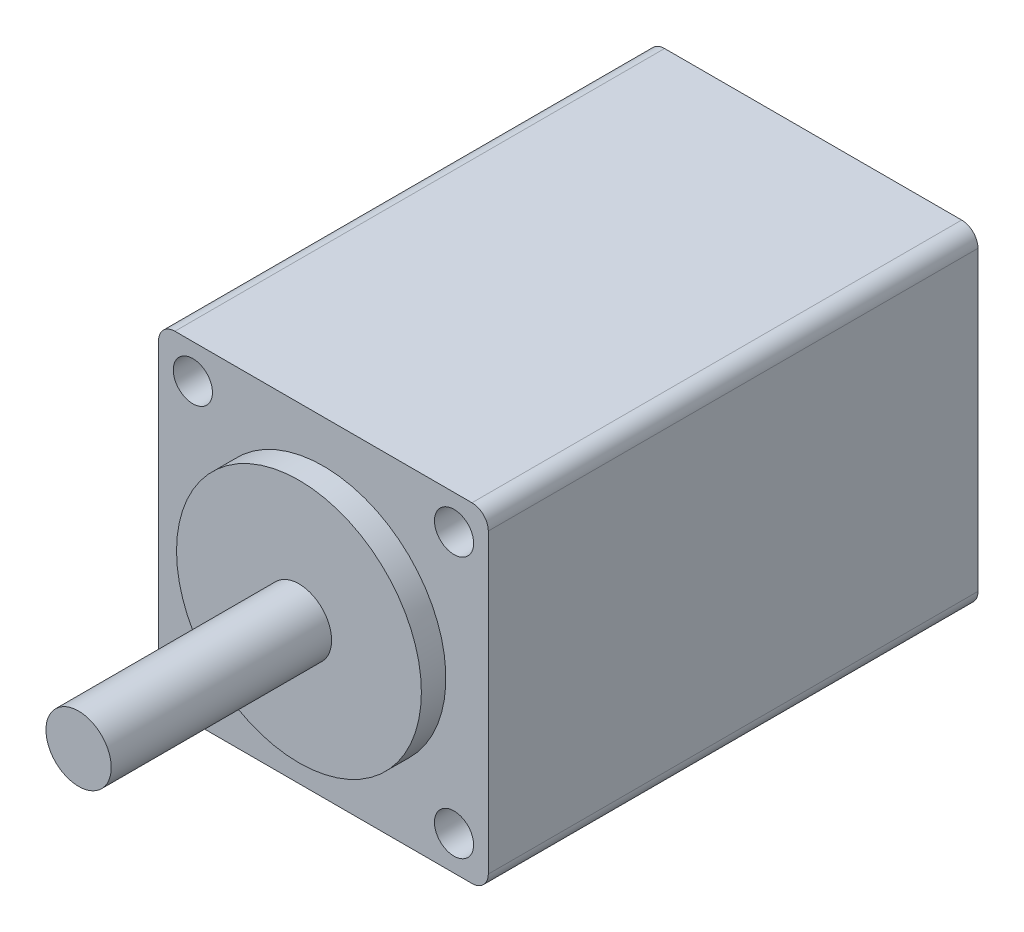
ISO-10303-21;
HEADER;
FILE_DESCRIPTION(('STEP AP214'),'2;1');
FILE_NAME('part.step','',(''),(''),'','','');
FILE_SCHEMA(('AUTOMOTIVE_DESIGN { 1 0 10303 214 1 1 1 1 }'));
ENDSEC;
DATA;
#1=APPLICATION_CONTEXT('core data for automotive mechanical design processes');
#2=APPLICATION_PROTOCOL_DEFINITION('international standard','automotive_design',2000,#1);
#3=PRODUCT_CONTEXT('',#1,'mechanical');
#4=PRODUCT('Part','Part','',(#3));
#5=PRODUCT_RELATED_PRODUCT_CATEGORY('part','',(#4));
#6=PRODUCT_DEFINITION_FORMATION('','',#4);
#7=PRODUCT_DEFINITION_CONTEXT('part definition',#1,'design');
#8=PRODUCT_DEFINITION('design','',#6,#7);
#9=PRODUCT_DEFINITION_SHAPE('','',#8);
#10=(LENGTH_UNIT() NAMED_UNIT(*) SI_UNIT(.MILLI.,.METRE.));
#11=(NAMED_UNIT(*) PLANE_ANGLE_UNIT() SI_UNIT($,.RADIAN.));
#12=(NAMED_UNIT(*) SI_UNIT($,.STERADIAN.) SOLID_ANGLE_UNIT());
#13=UNCERTAINTY_MEASURE_WITH_UNIT(LENGTH_MEASURE(1.E-05),#10,'distance_accuracy_value','');
#14=(GEOMETRIC_REPRESENTATION_CONTEXT(3) GLOBAL_UNCERTAINTY_ASSIGNED_CONTEXT((#13)) GLOBAL_UNIT_ASSIGNED_CONTEXT((#10,
#11,#12)) REPRESENTATION_CONTEXT('',''));
#15=CARTESIAN_POINT('',(0.,0.,0.));
#16=DIRECTION('',(0.,0.,1.));
#17=DIRECTION('',(1.,0.,0.));
#18=AXIS2_PLACEMENT_3D('',#15,#16,#17);
#19=CARTESIAN_POINT('',(-10.1,-10.1,-30.));
#20=DIRECTION('',(-1.,0.,0.));
#21=DIRECTION('',(0.,0.,1.));
#22=AXIS2_PLACEMENT_3D('',#19,#20,#21);
#23=PLANE('',#22);
#24=DIRECTION('',(0.,-1.,0.));
#25=VECTOR('',#24,1.);
#26=CARTESIAN_POINT('',(-10.1,-10.1,0.));
#27=LINE('',#26,#25);
#28=CARTESIAN_POINT('',(-10.1,9.1,0.));
#29=VERTEX_POINT('',#28);
#30=CARTESIAN_POINT('',(-10.1,-9.1,0.));
#31=VERTEX_POINT('',#30);
#32=EDGE_CURVE('E159',#29,#31,#27,.T.);
#33=ORIENTED_EDGE('',*,*,#32,.F.);
#34=DIRECTION('',(0.,0.,1.));
#35=VECTOR('',#34,1.);
#36=CARTESIAN_POINT('',(-10.1,9.1,-30.));
#37=LINE('',#36,#35);
#38=CARTESIAN_POINT('',(-10.1,9.1,-30.));
#39=VERTEX_POINT('',#38);
#40=EDGE_CURVE('E137',#29,#39,#37,.F.);
#41=ORIENTED_EDGE('',*,*,#40,.T.);
#42=DIRECTION('',(0.,-1.,0.));
#43=VECTOR('',#42,1.);
#44=CARTESIAN_POINT('',(-10.1,-10.1,-30.));
#45=LINE('',#44,#43);
#46=CARTESIAN_POINT('',(-10.1,-9.1,-30.));
#47=VERTEX_POINT('',#46);
#48=EDGE_CURVE('E118',#39,#47,#45,.T.);
#49=ORIENTED_EDGE('',*,*,#48,.T.);
#50=DIRECTION('',(0.,0.,1.));
#51=VECTOR('',#50,1.);
#52=CARTESIAN_POINT('',(-10.1,-9.1,-30.));
#53=LINE('',#52,#51);
#54=EDGE_CURVE('E134',#47,#31,#53,.T.);
#55=ORIENTED_EDGE('',*,*,#54,.T.);
#56=EDGE_LOOP('',(#33,#41,#49,#55));
#57=FACE_BOUND('',#56,.T.);
#58=ADVANCED_FACE('F32',(#57),#23,.T.);
#59=CARTESIAN_POINT('',(-10.1,10.1,-30.));
#60=DIRECTION('',(0.,1.,0.));
#61=DIRECTION('',(0.,0.,1.));
#62=AXIS2_PLACEMENT_3D('',#59,#60,#61);
#63=PLANE('',#62);
#64=DIRECTION('',(-1.,0.,0.));
#65=VECTOR('',#64,1.);
#66=CARTESIAN_POINT('',(-10.1,10.1,-30.));
#67=LINE('',#66,#65);
#68=CARTESIAN_POINT('',(9.10000000000001,10.1,-30.));
#69=VERTEX_POINT('',#68);
#70=CARTESIAN_POINT('',(-9.1,10.1,-30.));
#71=VERTEX_POINT('',#70);
#72=EDGE_CURVE('E126',#69,#71,#67,.T.);
#73=ORIENTED_EDGE('',*,*,#72,.T.);
#74=DIRECTION('',(0.,0.,1.));
#75=VECTOR('',#74,1.);
#76=CARTESIAN_POINT('',(-9.1,10.1,-30.));
#77=LINE('',#76,#75);
#78=CARTESIAN_POINT('',(-9.1,10.1,0.));
#79=VERTEX_POINT('',#78);
#80=EDGE_CURVE('E109',#71,#79,#77,.T.);
#81=ORIENTED_EDGE('',*,*,#80,.T.);
#82=DIRECTION('',(-1.,0.,0.));
#83=VECTOR('',#82,1.);
#84=CARTESIAN_POINT('',(-10.1,10.1,0.));
#85=LINE('',#84,#83);
#86=CARTESIAN_POINT('',(9.10000000000001,10.1,0.));
#87=VERTEX_POINT('',#86);
#88=EDGE_CURVE('E101',#87,#79,#85,.T.);
#89=ORIENTED_EDGE('',*,*,#88,.F.);
#90=DIRECTION('',(0.,0.,1.));
#91=VECTOR('',#90,1.);
#92=CARTESIAN_POINT('',(9.10000000000001,10.1,-30.));
#93=LINE('',#92,#91);
#94=EDGE_CURVE('E115',#87,#69,#93,.F.);
#95=ORIENTED_EDGE('',*,*,#94,.T.);
#96=EDGE_LOOP('',(#73,#81,#89,#95));
#97=FACE_BOUND('',#96,.T.);
#98=ADVANCED_FACE('F114',(#97),#63,.T.);
#99=CARTESIAN_POINT('',(10.1,-10.1,-30.));
#100=DIRECTION('',(1.,0.,0.));
#101=DIRECTION('',(0.,1.,0.));
#102=AXIS2_PLACEMENT_3D('',#99,#100,#101);
#103=PLANE('',#102);
#104=DIRECTION('',(0.,1.,0.));
#105=VECTOR('',#104,1.);
#106=CARTESIAN_POINT('',(10.1,-10.1,0.));
#107=LINE('',#106,#105);
#108=CARTESIAN_POINT('',(10.1,-9.1,0.));
#109=VERTEX_POINT('',#108);
#110=CARTESIAN_POINT('',(10.1,9.1,0.));
#111=VERTEX_POINT('',#110);
#112=EDGE_CURVE('E103',#109,#111,#107,.T.);
#113=ORIENTED_EDGE('',*,*,#112,.F.);
#114=DIRECTION('',(0.,0.,1.));
#115=VECTOR('',#114,1.);
#116=CARTESIAN_POINT('',(10.1,-9.1,-30.));
#117=LINE('',#116,#115);
#118=CARTESIAN_POINT('',(10.1,-9.1,-30.));
#119=VERTEX_POINT('',#118);
#120=EDGE_CURVE('E11',#109,#119,#117,.F.);
#121=ORIENTED_EDGE('',*,*,#120,.T.);
#122=DIRECTION('',(0.,1.,0.));
#123=VECTOR('',#122,1.);
#124=CARTESIAN_POINT('',(10.1,-10.1,-30.));
#125=LINE('',#124,#123);
#126=CARTESIAN_POINT('',(10.1,9.1,-30.));
#127=VERTEX_POINT('',#126);
#128=EDGE_CURVE('E152',#119,#127,#125,.T.);
#129=ORIENTED_EDGE('',*,*,#128,.T.);
#130=DIRECTION('',(0.,0.,1.));
#131=VECTOR('',#130,1.);
#132=CARTESIAN_POINT('',(10.1,9.1,-30.));
#133=LINE('',#132,#131);
#134=EDGE_CURVE('E40',#127,#111,#133,.T.);
#135=ORIENTED_EDGE('',*,*,#134,.T.);
#136=EDGE_LOOP('',(#113,#121,#129,#135));
#137=FACE_BOUND('',#136,.T.);
#138=ADVANCED_FACE('F150',(#137),#103,.T.);
#139=CARTESIAN_POINT('',(-10.1,-10.1,-30.));
#140=DIRECTION('',(0.,-1.,0.));
#141=DIRECTION('',(1.,0.,0.));
#142=AXIS2_PLACEMENT_3D('',#139,#140,#141);
#143=PLANE('',#142);
#144=DIRECTION('',(1.,0.,0.));
#145=VECTOR('',#144,1.);
#146=CARTESIAN_POINT('',(-10.1,-10.1,0.));
#147=LINE('',#146,#145);
#148=CARTESIAN_POINT('',(-9.1,-10.1,0.));
#149=VERTEX_POINT('',#148);
#150=CARTESIAN_POINT('',(9.1,-10.1,0.));
#151=VERTEX_POINT('',#150);
#152=EDGE_CURVE('E162',#149,#151,#147,.T.);
#153=ORIENTED_EDGE('',*,*,#152,.F.);
#154=DIRECTION('',(0.,0.,1.));
#155=VECTOR('',#154,1.);
#156=CARTESIAN_POINT('',(-9.1,-10.1,-30.));
#157=LINE('',#156,#155);
#158=CARTESIAN_POINT('',(-9.1,-10.1,-30.));
#159=VERTEX_POINT('',#158);
#160=EDGE_CURVE('E54',#149,#159,#157,.F.);
#161=ORIENTED_EDGE('',*,*,#160,.T.);
#162=DIRECTION('',(1.,0.,0.));
#163=VECTOR('',#162,1.);
#164=CARTESIAN_POINT('',(-10.1,-10.1,-30.));
#165=LINE('',#164,#163);
#166=CARTESIAN_POINT('',(9.1,-10.1,-30.));
#167=VERTEX_POINT('',#166);
#168=EDGE_CURVE('E153',#159,#167,#165,.T.);
#169=ORIENTED_EDGE('',*,*,#168,.T.);
#170=DIRECTION('',(0.,0.,1.));
#171=VECTOR('',#170,1.);
#172=CARTESIAN_POINT('',(9.1,-10.1,-30.));
#173=LINE('',#172,#171);
#174=EDGE_CURVE('E145',#167,#151,#173,.T.);
#175=ORIENTED_EDGE('',*,*,#174,.T.);
#176=EDGE_LOOP('',(#153,#161,#169,#175));
#177=FACE_BOUND('',#176,.T.);
#178=ADVANCED_FACE('F166',(#177),#143,.T.);
#179=CARTESIAN_POINT('',(0.,0.,-30.));
#180=DIRECTION('',(0.,0.,-1.));
#181=DIRECTION('',(-1.,0.,0.));
#182=AXIS2_PLACEMENT_3D('',#179,#180,#181);
#183=PLANE('',#182);
#184=ORIENTED_EDGE('',*,*,#48,.F.);
#185=CARTESIAN_POINT('',(-9.1,9.1,-30.));
#186=DIRECTION('',(0.,0.,-1.));
#187=DIRECTION('',(-1.,0.,0.));
#188=AXIS2_PLACEMENT_3D('',#185,#186,#187);
#189=CIRCLE('',#188,1.);
#190=EDGE_CURVE('E143',#39,#71,#189,.T.);
#191=ORIENTED_EDGE('',*,*,#190,.T.);
#192=ORIENTED_EDGE('',*,*,#72,.F.);
#193=CARTESIAN_POINT('',(9.1,9.1,-30.));
#194=DIRECTION('',(0.,0.,-1.));
#195=DIRECTION('',(-1.,0.,0.));
#196=AXIS2_PLACEMENT_3D('',#193,#194,#195);
#197=CIRCLE('',#196,1.);
#198=EDGE_CURVE('E121',#69,#127,#197,.T.);
#199=ORIENTED_EDGE('',*,*,#198,.T.);
#200=ORIENTED_EDGE('',*,*,#128,.F.);
#201=CARTESIAN_POINT('',(9.1,-9.1,-30.));
#202=DIRECTION('',(0.,0.,-1.));
#203=DIRECTION('',(-1.,0.,0.));
#204=AXIS2_PLACEMENT_3D('',#201,#202,#203);
#205=CIRCLE('',#204,1.);
#206=EDGE_CURVE('E47',#119,#167,#205,.T.);
#207=ORIENTED_EDGE('',*,*,#206,.T.);
#208=ORIENTED_EDGE('',*,*,#168,.F.);
#209=CARTESIAN_POINT('',(-9.1,-9.1,-30.));
#210=DIRECTION('',(0.,0.,-1.));
#211=DIRECTION('',(-1.,0.,0.));
#212=AXIS2_PLACEMENT_3D('',#209,#210,#211);
#213=CIRCLE('',#212,1.);
#214=EDGE_CURVE('E141',#159,#47,#213,.T.);
#215=ORIENTED_EDGE('',*,*,#214,.T.);
#216=EDGE_LOOP('',(#184,#191,#192,#199,#200,#207,#208,#215));
#217=FACE_BOUND('',#216,.T.);
#218=ADVANCED_FACE('F174',(#217),#183,.T.);
#219=CARTESIAN_POINT('',(0.,0.,0.));
#220=DIRECTION('',(0.,0.,-1.));
#221=DIRECTION('',(-1.,0.,0.));
#222=AXIS2_PLACEMENT_3D('',#219,#220,#221);
#223=PLANE('',#222);
#224=CARTESIAN_POINT('',(-8.,-8.,0.));
#225=DIRECTION('',(0.,0.,1.));
#226=DIRECTION('',(-1.,0.,0.));
#227=AXIS2_PLACEMENT_3D('',#224,#225,#226);
#228=CIRCLE('',#227,1.2);
#229=CARTESIAN_POINT('',(-9.2,-8.,0.));
#230=VERTEX_POINT('',#229);
#231=EDGE_CURVE('E207',#230,#230,#228,.T.);
#232=ORIENTED_EDGE('',*,*,#231,.F.);
#233=EDGE_LOOP('',(#232));
#234=FACE_BOUND('',#233,.T.);
#235=CARTESIAN_POINT('',(8.,-8.,0.));
#236=DIRECTION('',(0.,0.,1.));
#237=DIRECTION('',(1.,0.,0.));
#238=AXIS2_PLACEMENT_3D('',#235,#236,#237);
#239=CIRCLE('',#238,1.2);
#240=CARTESIAN_POINT('',(9.2,-8.,0.));
#241=VERTEX_POINT('',#240);
#242=EDGE_CURVE('E201',#241,#241,#239,.T.);
#243=ORIENTED_EDGE('',*,*,#242,.F.);
#244=EDGE_LOOP('',(#243));
#245=FACE_BOUND('',#244,.T.);
#246=CARTESIAN_POINT('',(8.,8.,0.));
#247=DIRECTION('',(0.,0.,1.));
#248=DIRECTION('',(-1.,0.,0.));
#249=AXIS2_PLACEMENT_3D('',#246,#247,#248);
#250=CIRCLE('',#249,1.2);
#251=CARTESIAN_POINT('',(6.8,8.,0.));
#252=VERTEX_POINT('',#251);
#253=EDGE_CURVE('E195',#252,#252,#250,.T.);
#254=ORIENTED_EDGE('',*,*,#253,.F.);
#255=EDGE_LOOP('',(#254));
#256=FACE_BOUND('',#255,.T.);
#257=CARTESIAN_POINT('',(-8.,8.,0.));
#258=DIRECTION('',(0.,0.,1.));
#259=DIRECTION('',(1.,0.,0.));
#260=AXIS2_PLACEMENT_3D('',#257,#258,#259);
#261=CIRCLE('',#260,1.2);
#262=CARTESIAN_POINT('',(-6.8,8.,0.));
#263=VERTEX_POINT('',#262);
#264=EDGE_CURVE('E189',#263,#263,#261,.T.);
#265=ORIENTED_EDGE('',*,*,#264,.F.);
#266=EDGE_LOOP('',(#265));
#267=FACE_BOUND('',#266,.T.);
#268=CARTESIAN_POINT('',(0.,0.,0.));
#269=DIRECTION('',(0.,0.,-1.));
#270=DIRECTION('',(-1.,0.,0.));
#271=AXIS2_PLACEMENT_3D('',#268,#269,#270);
#272=CIRCLE('',#271,7.5);
#273=CARTESIAN_POINT('',(-7.5,0.,0.));
#274=VERTEX_POINT('',#273);
#275=EDGE_CURVE('E122',#274,#274,#272,.F.);
#276=ORIENTED_EDGE('',*,*,#275,.F.);
#277=EDGE_LOOP('',(#276));
#278=FACE_BOUND('',#277,.T.);
#279=ORIENTED_EDGE('',*,*,#88,.T.);
#280=CARTESIAN_POINT('',(-9.1,9.1,0.));
#281=DIRECTION('',(0.,0.,-1.));
#282=DIRECTION('',(-1.,0.,0.));
#283=AXIS2_PLACEMENT_3D('',#280,#281,#282);
#284=CIRCLE('',#283,1.);
#285=EDGE_CURVE('E132',#79,#29,#284,.F.);
#286=ORIENTED_EDGE('',*,*,#285,.T.);
#287=ORIENTED_EDGE('',*,*,#32,.T.);
#288=CARTESIAN_POINT('',(-9.1,-9.1,0.));
#289=DIRECTION('',(0.,0.,-1.));
#290=DIRECTION('',(-1.,0.,0.));
#291=AXIS2_PLACEMENT_3D('',#288,#289,#290);
#292=CIRCLE('',#291,1.);
#293=EDGE_CURVE('E130',#31,#149,#292,.F.);
#294=ORIENTED_EDGE('',*,*,#293,.T.);
#295=ORIENTED_EDGE('',*,*,#152,.T.);
#296=CARTESIAN_POINT('',(9.1,-9.1,0.));
#297=DIRECTION('',(0.,0.,-1.));
#298=DIRECTION('',(-1.,0.,0.));
#299=AXIS2_PLACEMENT_3D('',#296,#297,#298);
#300=CIRCLE('',#299,1.);
#301=EDGE_CURVE('E108',#151,#109,#300,.F.);
#302=ORIENTED_EDGE('',*,*,#301,.T.);
#303=ORIENTED_EDGE('',*,*,#112,.T.);
#304=CARTESIAN_POINT('',(9.1,9.1,0.));
#305=DIRECTION('',(0.,0.,-1.));
#306=DIRECTION('',(-1.,0.,0.));
#307=AXIS2_PLACEMENT_3D('',#304,#305,#306);
#308=CIRCLE('',#307,1.);
#309=EDGE_CURVE('E98',#111,#87,#308,.F.);
#310=ORIENTED_EDGE('',*,*,#309,.T.);
#311=EDGE_LOOP('',(#279,#286,#287,#294,#295,#302,#303,#310));
#312=FACE_BOUND('',#311,.T.);
#313=ADVANCED_FACE('F100',(#234,#245,#256,#267,#278,#312),#223,.F.);
#314=CARTESIAN_POINT('',(0.,0.,1.5));
#315=DIRECTION('',(0.,0.,-1.));
#316=DIRECTION('',(-1.,0.,0.));
#317=AXIS2_PLACEMENT_3D('',#314,#315,#316);
#318=CYLINDRICAL_SURFACE('',#317,7.5);
#319=CARTESIAN_POINT('',(0.,0.,1.5));
#320=DIRECTION('',(0.,0.,1.));
#321=DIRECTION('',(1.,0.,0.));
#322=AXIS2_PLACEMENT_3D('',#319,#320,#321);
#323=CIRCLE('',#322,7.5);
#324=CARTESIAN_POINT('',(7.5,0.,1.5));
#325=VERTEX_POINT('',#324);
#326=EDGE_CURVE('E163',#325,#325,#323,.T.);
#327=ORIENTED_EDGE('',*,*,#326,.F.);
#328=EDGE_LOOP('',(#327));
#329=FACE_BOUND('',#328,.T.);
#330=ORIENTED_EDGE('',*,*,#275,.T.);
#331=EDGE_LOOP('',(#330));
#332=FACE_BOUND('',#331,.T.);
#333=ADVANCED_FACE('F224',(#329,#332),#318,.T.);
#334=CARTESIAN_POINT('',(0.,0.,1.5));
#335=DIRECTION('',(0.,0.,1.));
#336=DIRECTION('',(1.,0.,0.));
#337=AXIS2_PLACEMENT_3D('',#334,#335,#336);
#338=PLANE('',#337);
#339=CARTESIAN_POINT('',(0.,0.,1.5));
#340=DIRECTION('',(0.,0.,1.));
#341=DIRECTION('',(1.,0.,0.));
#342=AXIS2_PLACEMENT_3D('',#339,#340,#341);
#343=CIRCLE('',#342,2.);
#344=CARTESIAN_POINT('',(2.,0.,1.5));
#345=VERTEX_POINT('',#344);
#346=EDGE_CURVE('E183',#345,#345,#343,.T.);
#347=ORIENTED_EDGE('',*,*,#346,.F.);
#348=EDGE_LOOP('',(#347));
#349=FACE_BOUND('',#348,.T.);
#350=ORIENTED_EDGE('',*,*,#326,.T.);
#351=EDGE_LOOP('',(#350));
#352=FACE_BOUND('',#351,.T.);
#353=ADVANCED_FACE('F235',(#349,#352),#338,.T.);
#354=CARTESIAN_POINT('',(0.,0.,15.));
#355=DIRECTION('',(0.,0.,-1.));
#356=DIRECTION('',(-1.,0.,0.));
#357=AXIS2_PLACEMENT_3D('',#354,#355,#356);
#358=CYLINDRICAL_SURFACE('',#357,2.);
#359=CARTESIAN_POINT('',(0.,0.,15.));
#360=DIRECTION('',(0.,0.,1.));
#361=DIRECTION('',(1.,0.,0.));
#362=AXIS2_PLACEMENT_3D('',#359,#360,#361);
#363=CIRCLE('',#362,2.);
#364=CARTESIAN_POINT('',(2.,0.,15.));
#365=VERTEX_POINT('',#364);
#366=EDGE_CURVE('E182',#365,#365,#363,.T.);
#367=ORIENTED_EDGE('',*,*,#366,.F.);
#368=EDGE_LOOP('',(#367));
#369=FACE_BOUND('',#368,.T.);
#370=ORIENTED_EDGE('',*,*,#346,.T.);
#371=EDGE_LOOP('',(#370));
#372=FACE_BOUND('',#371,.T.);
#373=ADVANCED_FACE('F241',(#369,#372),#358,.T.);
#374=CARTESIAN_POINT('',(0.,0.,15.));
#375=DIRECTION('',(0.,0.,1.));
#376=DIRECTION('',(1.,0.,0.));
#377=AXIS2_PLACEMENT_3D('',#374,#375,#376);
#378=PLANE('',#377);
#379=ORIENTED_EDGE('',*,*,#366,.T.);
#380=EDGE_LOOP('',(#379));
#381=FACE_BOUND('',#380,.T.);
#382=ADVANCED_FACE('F395',(#381),#378,.T.);
#383=CARTESIAN_POINT('',(-8.,8.,-3.5));
#384=DIRECTION('',(0.,0.,1.));
#385=DIRECTION('',(1.,0.,0.));
#386=AXIS2_PLACEMENT_3D('',#383,#384,#385);
#387=CYLINDRICAL_SURFACE('',#386,1.2);
#388=CARTESIAN_POINT('',(-8.,8.,-3.5));
#389=DIRECTION('',(0.,0.,1.));
#390=DIRECTION('',(1.,0.,0.));
#391=AXIS2_PLACEMENT_3D('',#388,#389,#390);
#392=CIRCLE('',#391,1.2);
#393=CARTESIAN_POINT('',(-6.8,8.,-3.5));
#394=VERTEX_POINT('',#393);
#395=EDGE_CURVE('E186',#394,#394,#392,.T.);
#396=ORIENTED_EDGE('',*,*,#395,.F.);
#397=EDGE_LOOP('',(#396));
#398=FACE_BOUND('',#397,.T.);
#399=ORIENTED_EDGE('',*,*,#264,.T.);
#400=EDGE_LOOP('',(#399));
#401=FACE_BOUND('',#400,.T.);
#402=ADVANCED_FACE('F385',(#398,#401),#387,.F.);
#403=CARTESIAN_POINT('',(-8.,8.,-3.5));
#404=DIRECTION('',(0.,0.,1.));
#405=DIRECTION('',(1.,0.,0.));
#406=AXIS2_PLACEMENT_3D('',#403,#404,#405);
#407=PLANE('',#406);
#408=ORIENTED_EDGE('',*,*,#395,.T.);
#409=EDGE_LOOP('',(#408));
#410=FACE_BOUND('',#409,.T.);
#411=ADVANCED_FACE('F375',(#410),#407,.T.);
#412=CARTESIAN_POINT('',(8.,8.,-3.5));
#413=DIRECTION('',(0.,0.,1.));
#414=DIRECTION('',(1.,0.,0.));
#415=AXIS2_PLACEMENT_3D('',#412,#413,#414);
#416=CYLINDRICAL_SURFACE('',#415,1.2);
#417=CARTESIAN_POINT('',(8.,8.,-3.5));
#418=DIRECTION('',(0.,0.,1.));
#419=DIRECTION('',(-1.,0.,0.));
#420=AXIS2_PLACEMENT_3D('',#417,#418,#419);
#421=CIRCLE('',#420,1.2);
#422=CARTESIAN_POINT('',(6.8,8.,-3.5));
#423=VERTEX_POINT('',#422);
#424=EDGE_CURVE('E192',#423,#423,#421,.T.);
#425=ORIENTED_EDGE('',*,*,#424,.F.);
#426=EDGE_LOOP('',(#425));
#427=FACE_BOUND('',#426,.T.);
#428=ORIENTED_EDGE('',*,*,#253,.T.);
#429=EDGE_LOOP('',(#428));
#430=FACE_BOUND('',#429,.T.);
#431=ADVANCED_FACE('F365',(#427,#430),#416,.F.);
#432=CARTESIAN_POINT('',(8.,8.,-3.5));
#433=DIRECTION('',(0.,0.,-1.));
#434=DIRECTION('',(-1.,0.,0.));
#435=AXIS2_PLACEMENT_3D('',#432,#433,#434);
#436=PLANE('',#435);
#437=ORIENTED_EDGE('',*,*,#424,.T.);
#438=EDGE_LOOP('',(#437));
#439=FACE_BOUND('',#438,.T.);
#440=ADVANCED_FACE('F355',(#439),#436,.F.);
#441=CARTESIAN_POINT('',(8.,-8.,-3.5));
#442=DIRECTION('',(0.,0.,1.));
#443=DIRECTION('',(1.,0.,0.));
#444=AXIS2_PLACEMENT_3D('',#441,#442,#443);
#445=CYLINDRICAL_SURFACE('',#444,1.2);
#446=CARTESIAN_POINT('',(8.,-8.,-3.5));
#447=DIRECTION('',(0.,0.,1.));
#448=DIRECTION('',(1.,0.,0.));
#449=AXIS2_PLACEMENT_3D('',#446,#447,#448);
#450=CIRCLE('',#449,1.2);
#451=CARTESIAN_POINT('',(9.2,-8.,-3.5));
#452=VERTEX_POINT('',#451);
#453=EDGE_CURVE('E198',#452,#452,#450,.T.);
#454=ORIENTED_EDGE('',*,*,#453,.F.);
#455=EDGE_LOOP('',(#454));
#456=FACE_BOUND('',#455,.T.);
#457=ORIENTED_EDGE('',*,*,#242,.T.);
#458=EDGE_LOOP('',(#457));
#459=FACE_BOUND('',#458,.T.);
#460=ADVANCED_FACE('F345',(#456,#459),#445,.F.);
#461=CARTESIAN_POINT('',(8.,-8.,-3.5));
#462=DIRECTION('',(0.,0.,1.));
#463=DIRECTION('',(1.,0.,0.));
#464=AXIS2_PLACEMENT_3D('',#461,#462,#463);
#465=PLANE('',#464);
#466=ORIENTED_EDGE('',*,*,#453,.T.);
#467=EDGE_LOOP('',(#466));
#468=FACE_BOUND('',#467,.T.);
#469=ADVANCED_FACE('F218',(#468),#465,.T.);
#470=CARTESIAN_POINT('',(-8.,-8.,-3.5));
#471=DIRECTION('',(0.,0.,1.));
#472=DIRECTION('',(1.,0.,0.));
#473=AXIS2_PLACEMENT_3D('',#470,#471,#472);
#474=CYLINDRICAL_SURFACE('',#473,1.2);
#475=CARTESIAN_POINT('',(-8.,-8.,-3.5));
#476=DIRECTION('',(0.,0.,1.));
#477=DIRECTION('',(-1.,0.,0.));
#478=AXIS2_PLACEMENT_3D('',#475,#476,#477);
#479=CIRCLE('',#478,1.2);
#480=CARTESIAN_POINT('',(-9.2,-8.,-3.5));
#481=VERTEX_POINT('',#480);
#482=EDGE_CURVE('E204',#481,#481,#479,.T.);
#483=ORIENTED_EDGE('',*,*,#482,.F.);
#484=EDGE_LOOP('',(#483));
#485=FACE_BOUND('',#484,.T.);
#486=ORIENTED_EDGE('',*,*,#231,.T.);
#487=EDGE_LOOP('',(#486));
#488=FACE_BOUND('',#487,.T.);
#489=ADVANCED_FACE('F215',(#485,#488),#474,.F.);
#490=CARTESIAN_POINT('',(-8.,-8.,-3.5));
#491=DIRECTION('',(0.,0.,-1.));
#492=DIRECTION('',(-1.,0.,0.));
#493=AXIS2_PLACEMENT_3D('',#490,#491,#492);
#494=PLANE('',#493);
#495=ORIENTED_EDGE('',*,*,#482,.T.);
#496=EDGE_LOOP('',(#495));
#497=FACE_BOUND('',#496,.T.);
#498=ADVANCED_FACE('F213',(#497),#494,.F.);
#499=CARTESIAN_POINT('',(-9.1,9.1,-30.));
#500=DIRECTION('',(0.,0.,1.));
#501=DIRECTION('',(1.,0.,0.));
#502=AXIS2_PLACEMENT_3D('',#499,#500,#501);
#503=CYLINDRICAL_SURFACE('',#502,1.);
#504=ORIENTED_EDGE('',*,*,#190,.F.);
#505=ORIENTED_EDGE('',*,*,#40,.F.);
#506=ORIENTED_EDGE('',*,*,#285,.F.);
#507=ORIENTED_EDGE('',*,*,#80,.F.);
#508=EDGE_LOOP('',(#504,#505,#506,#507));
#509=FACE_BOUND('',#508,.T.);
#510=ADVANCED_FACE('F255',(#509),#503,.T.);
#511=CARTESIAN_POINT('',(-9.1,-9.1,-30.));
#512=DIRECTION('',(0.,0.,1.));
#513=DIRECTION('',(1.,0.,0.));
#514=AXIS2_PLACEMENT_3D('',#511,#512,#513);
#515=CYLINDRICAL_SURFACE('',#514,1.);
#516=ORIENTED_EDGE('',*,*,#214,.F.);
#517=ORIENTED_EDGE('',*,*,#160,.F.);
#518=ORIENTED_EDGE('',*,*,#293,.F.);
#519=ORIENTED_EDGE('',*,*,#54,.F.);
#520=EDGE_LOOP('',(#516,#517,#518,#519));
#521=FACE_BOUND('',#520,.T.);
#522=ADVANCED_FACE('F170',(#521),#515,.T.);
#523=CARTESIAN_POINT('',(9.1,-9.1,-30.));
#524=DIRECTION('',(0.,0.,1.));
#525=DIRECTION('',(1.,0.,0.));
#526=AXIS2_PLACEMENT_3D('',#523,#524,#525);
#527=CYLINDRICAL_SURFACE('',#526,1.);
#528=ORIENTED_EDGE('',*,*,#206,.F.);
#529=ORIENTED_EDGE('',*,*,#120,.F.);
#530=ORIENTED_EDGE('',*,*,#301,.F.);
#531=ORIENTED_EDGE('',*,*,#174,.F.);
#532=EDGE_LOOP('',(#528,#529,#530,#531));
#533=FACE_BOUND('',#532,.T.);
#534=ADVANCED_FACE('F260',(#533),#527,.T.);
#535=CARTESIAN_POINT('',(9.1,9.1,-30.));
#536=DIRECTION('',(0.,0.,1.));
#537=DIRECTION('',(1.,0.,0.));
#538=AXIS2_PLACEMENT_3D('',#535,#536,#537);
#539=CYLINDRICAL_SURFACE('',#538,1.);
#540=ORIENTED_EDGE('',*,*,#198,.F.);
#541=ORIENTED_EDGE('',*,*,#94,.F.);
#542=ORIENTED_EDGE('',*,*,#309,.F.);
#543=ORIENTED_EDGE('',*,*,#134,.F.);
#544=EDGE_LOOP('',(#540,#541,#542,#543));
#545=FACE_BOUND('',#544,.T.);
#546=ADVANCED_FACE('F34',(#545),#539,.T.);
#547=CLOSED_SHELL('',(#58,#98,#138,#178,#218,#313,#333,#353,#373,#382,#402,#411,#431,#440,#460,
#469,#489,#498,#510,#522,#534,#546));
#548=MANIFOLD_SOLID_BREP('B2',#547);
#549=ADVANCED_BREP_SHAPE_REPRESENTATION('',(#18,#548),#14);
#550=SHAPE_DEFINITION_REPRESENTATION(#9,#549);
ENDSEC;
END-ISO-10303-21;
